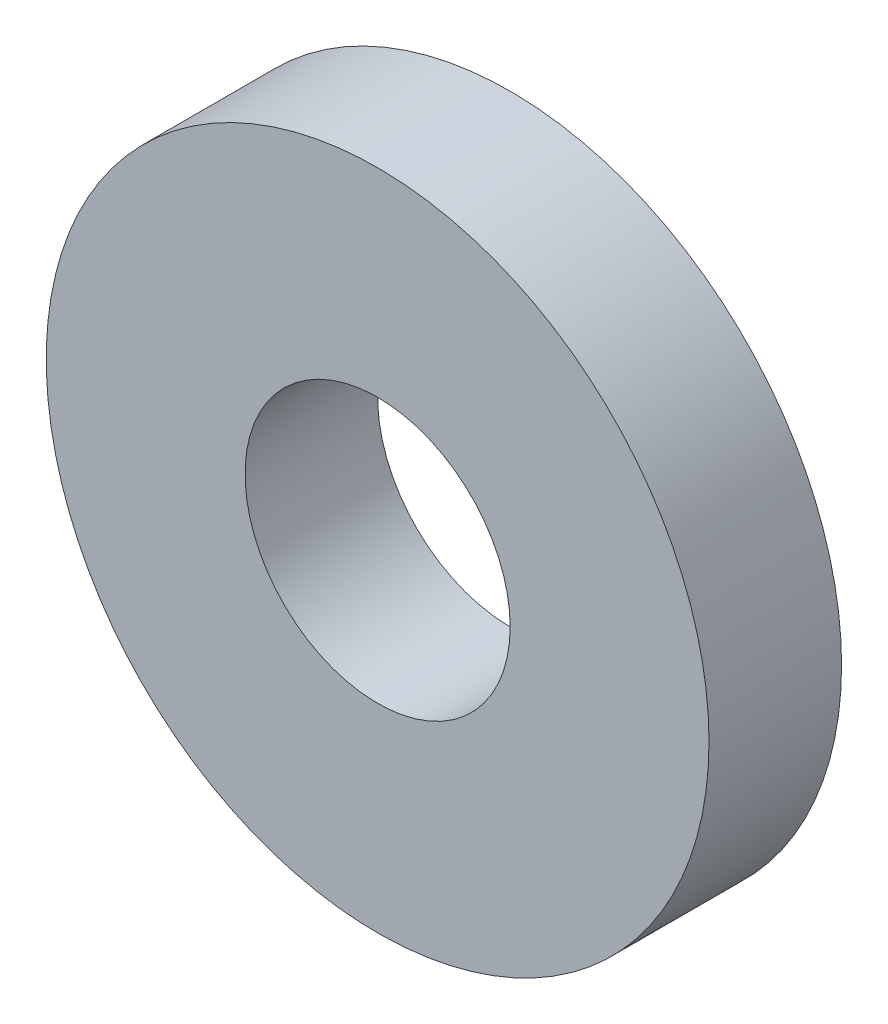
ISO-10303-21;
HEADER;
FILE_DESCRIPTION(('STEP AP214'),'2;1');
FILE_NAME('part.step','',(''),(''),'','','');
FILE_SCHEMA(('AUTOMOTIVE_DESIGN { 1 0 10303 214 1 1 1 1 }'));
ENDSEC;
DATA;
#1=APPLICATION_CONTEXT('core data for automotive mechanical design processes');
#2=APPLICATION_PROTOCOL_DEFINITION('international standard','automotive_design',2000,#1);
#3=PRODUCT_CONTEXT('',#1,'mechanical');
#4=PRODUCT('Part','Part','',(#3));
#5=PRODUCT_RELATED_PRODUCT_CATEGORY('part','',(#4));
#6=PRODUCT_DEFINITION_FORMATION('','',#4);
#7=PRODUCT_DEFINITION_CONTEXT('part definition',#1,'design');
#8=PRODUCT_DEFINITION('design','',#6,#7);
#9=PRODUCT_DEFINITION_SHAPE('','',#8);
#10=(LENGTH_UNIT() NAMED_UNIT(*) SI_UNIT(.MILLI.,.METRE.));
#11=(NAMED_UNIT(*) PLANE_ANGLE_UNIT() SI_UNIT($,.RADIAN.));
#12=(NAMED_UNIT(*) SI_UNIT($,.STERADIAN.) SOLID_ANGLE_UNIT());
#13=UNCERTAINTY_MEASURE_WITH_UNIT(LENGTH_MEASURE(1.E-05),#10,'distance_accuracy_value','');
#14=(GEOMETRIC_REPRESENTATION_CONTEXT(3) GLOBAL_UNCERTAINTY_ASSIGNED_CONTEXT((#13)) GLOBAL_UNIT_ASSIGNED_CONTEXT((#10,
#11,#12)) REPRESENTATION_CONTEXT('',''));
#15=CARTESIAN_POINT('',(0.,0.,0.));
#16=DIRECTION('',(0.,0.,1.));
#17=DIRECTION('',(1.,0.,0.));
#18=AXIS2_PLACEMENT_3D('',#15,#16,#17);
#19=CARTESIAN_POINT('',(0.,0.,5.));
#20=DIRECTION('',(0.,0.,-1.));
#21=DIRECTION('',(-1.,0.,0.));
#22=AXIS2_PLACEMENT_3D('',#19,#20,#21);
#23=CYLINDRICAL_SURFACE('',#22,12.5);
#24=CARTESIAN_POINT('',(0.,0.,5.));
#25=DIRECTION('',(0.,0.,1.));
#26=DIRECTION('',(1.,0.,0.));
#27=AXIS2_PLACEMENT_3D('',#24,#25,#26);
#28=CIRCLE('',#27,12.5);
#29=CARTESIAN_POINT('',(12.5,0.,5.));
#30=VERTEX_POINT('',#29);
#31=EDGE_CURVE('E10',#30,#30,#28,.T.);
#32=ORIENTED_EDGE('',*,*,#31,.F.);
#33=EDGE_LOOP('',(#32));
#34=FACE_BOUND('',#33,.T.);
#35=CARTESIAN_POINT('',(0.,0.,0.));
#36=DIRECTION('',(0.,0.,1.));
#37=DIRECTION('',(1.,0.,0.));
#38=AXIS2_PLACEMENT_3D('',#35,#36,#37);
#39=CIRCLE('',#38,12.5);
#40=CARTESIAN_POINT('',(12.5,0.,0.));
#41=VERTEX_POINT('',#40);
#42=EDGE_CURVE('E35',#41,#41,#39,.T.);
#43=ORIENTED_EDGE('',*,*,#42,.T.);
#44=EDGE_LOOP('',(#43));
#45=FACE_BOUND('',#44,.T.);
#46=ADVANCED_FACE('F32',(#34,#45),#23,.T.);
#47=CARTESIAN_POINT('',(0.,0.,5.));
#48=DIRECTION('',(0.,0.,1.));
#49=DIRECTION('',(1.,0.,0.));
#50=AXIS2_PLACEMENT_3D('',#47,#48,#49);
#51=PLANE('',#50);
#52=CARTESIAN_POINT('',(0.,0.,5.));
#53=DIRECTION('',(0.,0.,1.));
#54=DIRECTION('',(1.,0.,0.));
#55=AXIS2_PLACEMENT_3D('',#52,#53,#54);
#56=CIRCLE('',#55,5.);
#57=CARTESIAN_POINT('',(5.,0.,5.));
#58=VERTEX_POINT('',#57);
#59=EDGE_CURVE('E44',#58,#58,#56,.T.);
#60=ORIENTED_EDGE('',*,*,#59,.F.);
#61=EDGE_LOOP('',(#60));
#62=FACE_BOUND('',#61,.T.);
#63=ORIENTED_EDGE('',*,*,#31,.T.);
#64=EDGE_LOOP('',(#63));
#65=FACE_BOUND('',#64,.T.);
#66=ADVANCED_FACE('F59',(#62,#65),#51,.T.);
#67=CARTESIAN_POINT('',(0.,0.,0.));
#68=DIRECTION('',(0.,0.,1.));
#69=DIRECTION('',(1.,0.,0.));
#70=AXIS2_PLACEMENT_3D('',#67,#68,#69);
#71=PLANE('',#70);
#72=CARTESIAN_POINT('',(0.,0.,0.));
#73=DIRECTION('',(0.,0.,1.));
#74=DIRECTION('',(1.,0.,0.));
#75=AXIS2_PLACEMENT_3D('',#72,#73,#74);
#76=CIRCLE('',#75,5.);
#77=CARTESIAN_POINT('',(5.,0.,0.));
#78=VERTEX_POINT('',#77);
#79=EDGE_CURVE('E42',#78,#78,#76,.T.);
#80=ORIENTED_EDGE('',*,*,#79,.T.);
#81=EDGE_LOOP('',(#80));
#82=FACE_BOUND('',#81,.T.);
#83=ORIENTED_EDGE('',*,*,#42,.F.);
#84=EDGE_LOOP('',(#83));
#85=FACE_BOUND('',#84,.T.);
#86=ADVANCED_FACE('F50',(#82,#85),#71,.F.);
#87=CARTESIAN_POINT('',(0.,0.,0.));
#88=DIRECTION('',(0.,0.,1.));
#89=DIRECTION('',(1.,0.,0.));
#90=AXIS2_PLACEMENT_3D('',#87,#88,#89);
#91=CYLINDRICAL_SURFACE('',#90,5.);
#92=ORIENTED_EDGE('',*,*,#79,.F.);
#93=EDGE_LOOP('',(#92));
#94=FACE_BOUND('',#93,.T.);
#95=ORIENTED_EDGE('',*,*,#59,.T.);
#96=EDGE_LOOP('',(#95));
#97=FACE_BOUND('',#96,.T.);
#98=ADVANCED_FACE('F53',(#94,#97),#91,.F.);
#99=CLOSED_SHELL('',(#46,#66,#86,#98));
#100=MANIFOLD_SOLID_BREP('B2',#99);
#101=ADVANCED_BREP_SHAPE_REPRESENTATION('',(#18,#100),#14);
#102=SHAPE_DEFINITION_REPRESENTATION(#9,#101);
ENDSEC;
END-ISO-10303-21;
